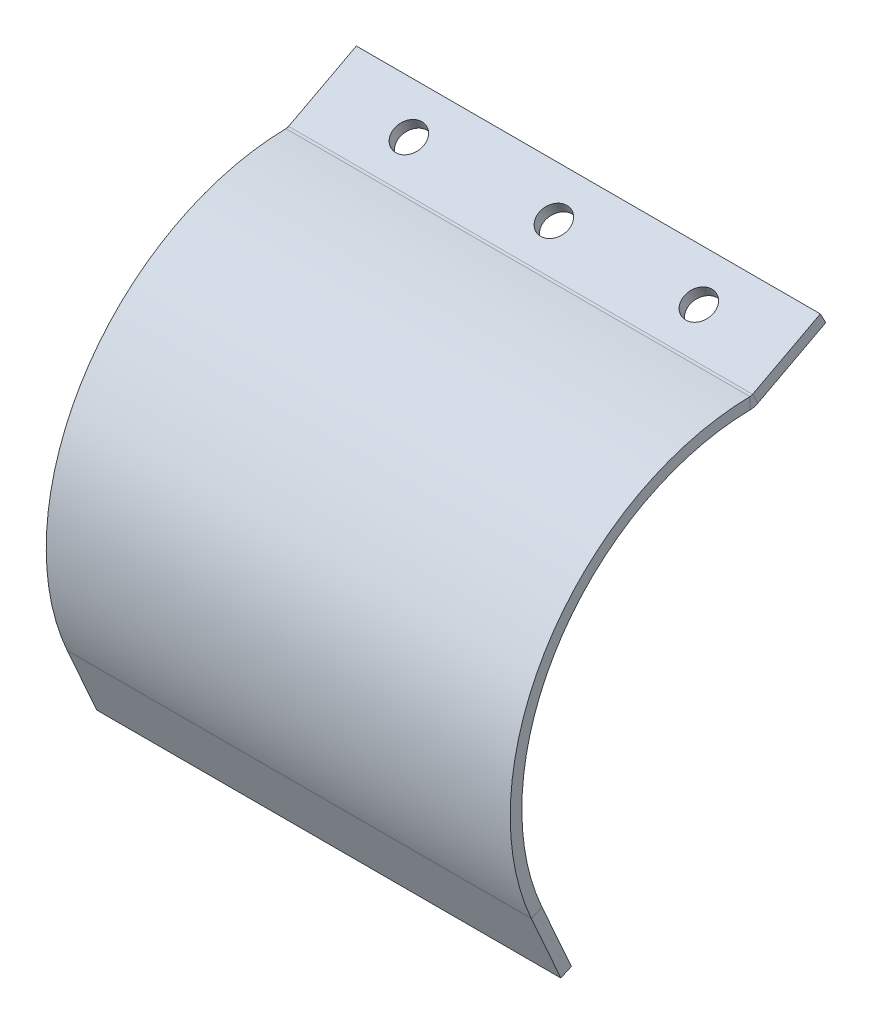
ISO-10303-21;
HEADER;
FILE_DESCRIPTION(('STEP AP214'),'2;1');
FILE_NAME('part.step','',(''),(''),'','','');
FILE_SCHEMA(('AUTOMOTIVE_DESIGN { 1 0 10303 214 1 1 1 1 }'));
ENDSEC;
DATA;
#1=APPLICATION_CONTEXT('core data for automotive mechanical design processes');
#2=APPLICATION_PROTOCOL_DEFINITION('international standard','automotive_design',2000,#1);
#3=PRODUCT_CONTEXT('',#1,'mechanical');
#4=PRODUCT('Part','Part','',(#3));
#5=PRODUCT_RELATED_PRODUCT_CATEGORY('part','',(#4));
#6=PRODUCT_DEFINITION_FORMATION('','',#4);
#7=PRODUCT_DEFINITION_CONTEXT('part definition',#1,'design');
#8=PRODUCT_DEFINITION('design','',#6,#7);
#9=PRODUCT_DEFINITION_SHAPE('','',#8);
#10=(LENGTH_UNIT() NAMED_UNIT(*) SI_UNIT(.MILLI.,.METRE.));
#11=(NAMED_UNIT(*) PLANE_ANGLE_UNIT() SI_UNIT($,.RADIAN.));
#12=(NAMED_UNIT(*) SI_UNIT($,.STERADIAN.) SOLID_ANGLE_UNIT());
#13=UNCERTAINTY_MEASURE_WITH_UNIT(LENGTH_MEASURE(1.E-05),#10,'distance_accuracy_value','');
#14=(GEOMETRIC_REPRESENTATION_CONTEXT(3) GLOBAL_UNCERTAINTY_ASSIGNED_CONTEXT((#13)) GLOBAL_UNIT_ASSIGNED_CONTEXT((#10,
#11,#12)) REPRESENTATION_CONTEXT('',''));
#15=CARTESIAN_POINT('',(0.,0.,0.));
#16=DIRECTION('',(0.,0.,1.));
#17=DIRECTION('',(1.,0.,0.));
#18=AXIS2_PLACEMENT_3D('',#15,#16,#17);
#19=CARTESIAN_POINT('',(80.,1.76916195043017,0.932773280679784));
#20=DIRECTION('',(1.,0.,0.));
#21=DIRECTION('',(0.,-0.466386640339892,0.884580975215084));
#22=AXIS2_PLACEMENT_3D('',#19,#20,#21);
#23=PLANE('',#22);
#24=DIRECTION('',(0.,0.884580975215083,0.466386640339892));
#25=VECTOR('',#24,1.);
#26=CARTESIAN_POINT('',(80.,-4.38997389138123,12.6146138785604));
#27=LINE('',#26,#25);
#28=CARTESIAN_POINT('',(80.,-6.1591358418114,11.6818405978806));
#29=VERTEX_POINT('',#28);
#30=CARTESIAN_POINT('',(80.,-4.38997389138123,12.6146138785604));
#31=VERTEX_POINT('',#30);
#32=EDGE_CURVE('E11',#29,#31,#27,.T.);
#33=ORIENTED_EDGE('',*,*,#32,.F.);
#34=DIRECTION('',(0.,0.466386640339892,-0.884580975215083));
#35=VECTOR('',#34,1.);
#36=CARTESIAN_POINT('',(80.,0.,0.));
#37=LINE('',#36,#35);
#38=CARTESIAN_POINT('',(80.,0.,0.));
#39=VERTEX_POINT('',#38);
#40=EDGE_CURVE('E97',#39,#29,#37,.F.);
#41=ORIENTED_EDGE('',*,*,#40,.F.);
#42=DIRECTION('',(0.,0.884580975215083,0.466386640339892));
#43=VECTOR('',#42,1.);
#44=CARTESIAN_POINT('',(80.,1.76916195043017,0.932773280679784));
#45=LINE('',#44,#43);
#46=CARTESIAN_POINT('',(80.,1.76916195043017,0.932773280679784));
#47=VERTEX_POINT('',#46);
#48=EDGE_CURVE('E51',#39,#47,#45,.T.);
#49=ORIENTED_EDGE('',*,*,#48,.T.);
#50=DIRECTION('',(0.,-0.466386640339892,0.884580975215084));
#51=VECTOR('',#50,1.);
#52=CARTESIAN_POINT('',(80.,1.76916195043017,0.932773280679784));
#53=LINE('',#52,#51);
#54=EDGE_CURVE('E100',#47,#31,#53,.T.);
#55=ORIENTED_EDGE('',*,*,#54,.T.);
#56=EDGE_LOOP('',(#33,#41,#49,#55));
#57=FACE_BOUND('',#56,.T.);
#58=ADVANCED_FACE('F41',(#57),#23,.T.);
#59=CARTESIAN_POINT('',(80.,1.76916195043017,0.932773280679784));
#60=DIRECTION('',(0.,-0.466386640339892,0.884580975215083));
#61=DIRECTION('',(-1.,0.,0.));
#62=AXIS2_PLACEMENT_3D('',#59,#60,#61);
#63=PLANE('',#62);
#64=ORIENTED_EDGE('',*,*,#48,.F.);
#65=DIRECTION('',(1.,0.,0.));
#66=VECTOR('',#65,1.);
#67=CARTESIAN_POINT('',(80.,0.,0.));
#68=LINE('',#67,#66);
#69=CARTESIAN_POINT('',(0.,0.,0.));
#70=VERTEX_POINT('',#69);
#71=EDGE_CURVE('E125',#39,#70,#68,.F.);
#72=ORIENTED_EDGE('',*,*,#71,.T.);
#73=DIRECTION('',(0.,0.884580975215083,0.466386640339892));
#74=VECTOR('',#73,1.);
#75=CARTESIAN_POINT('',(0.,1.76916195043017,0.932773280679784));
#76=LINE('',#75,#74);
#77=CARTESIAN_POINT('',(0.,1.76916195043017,0.932773280679784));
#78=VERTEX_POINT('',#77);
#79=EDGE_CURVE('E160',#70,#78,#76,.T.);
#80=ORIENTED_EDGE('',*,*,#79,.T.);
#81=DIRECTION('',(-1.,0.,0.));
#82=VECTOR('',#81,1.);
#83=CARTESIAN_POINT('',(80.,1.76916195043017,0.932773280679784));
#84=LINE('',#83,#82);
#85=EDGE_CURVE('E172',#47,#78,#84,.T.);
#86=ORIENTED_EDGE('',*,*,#85,.F.);
#87=EDGE_LOOP('',(#64,#72,#80,#86));
#88=FACE_BOUND('',#87,.T.);
#89=ADVANCED_FACE('F177',(#88),#63,.F.);
#90=CARTESIAN_POINT('',(0.,1.76916195043017,0.932773280679784));
#91=DIRECTION('',(1.,0.,0.));
#92=DIRECTION('',(0.,-0.466386640339892,0.884580975215084));
#93=AXIS2_PLACEMENT_3D('',#90,#91,#92);
#94=PLANE('',#93);
#95=ORIENTED_EDGE('',*,*,#79,.F.);
#96=DIRECTION('',(0.,0.466386640339892,-0.884580975215083));
#97=VECTOR('',#96,1.);
#98=CARTESIAN_POINT('',(0.,0.,0.));
#99=LINE('',#98,#97);
#100=CARTESIAN_POINT('',(0.,-6.1591358418114,11.6818405978806));
#101=VERTEX_POINT('',#100);
#102=EDGE_CURVE('E120',#70,#101,#99,.F.);
#103=ORIENTED_EDGE('',*,*,#102,.T.);
#104=DIRECTION('',(0.,0.884580975215085,0.466386640339889));
#105=VECTOR('',#104,1.);
#106=CARTESIAN_POINT('',(0.,-4.38997389138123,12.6146138785604));
#107=LINE('',#106,#105);
#108=CARTESIAN_POINT('',(0.,-4.38997389138123,12.6146138785604));
#109=VERTEX_POINT('',#108);
#110=EDGE_CURVE('E157',#101,#109,#107,.T.);
#111=ORIENTED_EDGE('',*,*,#110,.T.);
#112=DIRECTION('',(0.,-0.466386640339892,0.884580975215084));
#113=VECTOR('',#112,1.);
#114=CARTESIAN_POINT('',(0.,1.76916195043017,0.932773280679784));
#115=LINE('',#114,#113);
#116=EDGE_CURVE('E228',#78,#109,#115,.T.);
#117=ORIENTED_EDGE('',*,*,#116,.F.);
#118=EDGE_LOOP('',(#95,#103,#111,#117));
#119=FACE_BOUND('',#118,.T.);
#120=ADVANCED_FACE('F227',(#119),#94,.F.);
#121=CARTESIAN_POINT('',(0.,-3.50539291616614,13.0810005189003));
#122=DIRECTION('',(-1.,0.,0.));
#123=DIRECTION('',(0.,0.,1.));
#124=AXIS2_PLACEMENT_3D('',#121,#122,#123);
#125=PLANE('',#124);
#126=ORIENTED_EDGE('',*,*,#110,.F.);
#127=CARTESIAN_POINT('',(0.,-3.50539291616614,13.0810005189003));
#128=DIRECTION('',(-1.,0.,0.));
#129=DIRECTION('',(0.,0.,1.));
#130=AXIS2_PLACEMENT_3D('',#127,#128,#129);
#131=CIRCLE('',#130,3.);
#132=CARTESIAN_POINT('',(0.,-6.50501666620106,13.033488854791));
#133=VERTEX_POINT('',#132);
#134=EDGE_CURVE('E116',#133,#101,#131,.F.);
#135=ORIENTED_EDGE('',*,*,#134,.F.);
#136=DIRECTION('',(0.,0.999874583344974,0.0158372213697746));
#137=VECTOR('',#136,1.);
#138=CARTESIAN_POINT('',(0.,-4.50526749951112,13.0651632975305));
#139=LINE('',#138,#137);
#140=CARTESIAN_POINT('',(0.,-4.50526749951112,13.0651632975305));
#141=VERTEX_POINT('',#140);
#142=EDGE_CURVE('E154',#133,#141,#139,.T.);
#143=ORIENTED_EDGE('',*,*,#142,.T.);
#144=CARTESIAN_POINT('',(0.,-3.50539291616614,13.0810005189003));
#145=DIRECTION('',(1.,0.,0.));
#146=DIRECTION('',(0.,0.,-1.));
#147=AXIS2_PLACEMENT_3D('',#144,#145,#146);
#148=CIRCLE('',#147,1.);
#149=EDGE_CURVE('E180',#141,#109,#148,.T.);
#150=ORIENTED_EDGE('',*,*,#149,.T.);
#151=EDGE_LOOP('',(#126,#135,#143,#150));
#152=FACE_BOUND('',#151,.T.);
#153=ADVANCED_FACE('F402',(#152),#125,.T.);
#154=CARTESIAN_POINT('',(0.,-46.5,12.4));
#155=DIRECTION('',(-1.,0.,0.));
#156=DIRECTION('',(0.,0.,1.));
#157=AXIS2_PLACEMENT_3D('',#154,#155,#156);
#158=PLANE('',#157);
#159=ORIENTED_EDGE('',*,*,#142,.F.);
#160=CARTESIAN_POINT('',(0.,-46.5,12.4));
#161=DIRECTION('',(-1.,0.,0.));
#162=DIRECTION('',(0.,0.,1.));
#163=AXIS2_PLACEMENT_3D('',#160,#161,#162);
#164=CIRCLE('',#163,40.);
#165=CARTESIAN_POINT('',(0.,-62.7694657230322,48.941818305704));
#166=VERTEX_POINT('',#165);
#167=EDGE_CURVE('E216',#133,#166,#164,.F.);
#168=ORIENTED_EDGE('',*,*,#167,.T.);
#169=DIRECTION('',(0.,-0.406736643075803,0.913545457642599));
#170=VECTOR('',#169,1.);
#171=CARTESIAN_POINT('',(0.,-63.5829390091838,50.7689092209892));
#172=LINE('',#171,#170);
#173=CARTESIAN_POINT('',(0.,-63.5829390091838,50.7689092209892));
#174=VERTEX_POINT('',#173);
#175=EDGE_CURVE('E59',#166,#174,#172,.T.);
#176=ORIENTED_EDGE('',*,*,#175,.T.);
#177=CARTESIAN_POINT('',(0.,-46.5,12.4));
#178=DIRECTION('',(1.,0.,0.));
#179=DIRECTION('',(0.,0.,-1.));
#180=AXIS2_PLACEMENT_3D('',#177,#178,#179);
#181=CIRCLE('',#180,42.);
#182=EDGE_CURVE('E204',#141,#174,#181,.T.);
#183=ORIENTED_EDGE('',*,*,#182,.F.);
#184=EDGE_LOOP('',(#159,#168,#176,#183));
#185=FACE_BOUND('',#184,.T.);
#186=ADVANCED_FACE('F391',(#185),#158,.T.);
#187=CARTESIAN_POINT('',(0.,-63.5829390091838,50.7689092209891));
#188=DIRECTION('',(1.,0.,0.));
#189=DIRECTION('',(0.,-0.9135454576426,-0.406736643075803));
#190=AXIS2_PLACEMENT_3D('',#187,#188,#189);
#191=PLANE('',#190);
#192=ORIENTED_EDGE('',*,*,#175,.F.);
#193=DIRECTION('',(0.,0.9135454576426,0.406736643075803));
#194=VECTOR('',#193,1.);
#195=CARTESIAN_POINT('',(0.,-62.7694657230322,48.9418183057039));
#196=LINE('',#195,#194);
#197=CARTESIAN_POINT('',(0.,-74.2,43.8526165571953));
#198=VERTEX_POINT('',#197);
#199=EDGE_CURVE('E208',#166,#198,#196,.F.);
#200=ORIENTED_EDGE('',*,*,#199,.T.);
#201=DIRECTION('',(0.,-0.406736643075803,0.913545457642599));
#202=VECTOR('',#201,1.);
#203=CARTESIAN_POINT('',(0.,-75.0134732861516,45.6797074724806));
#204=LINE('',#203,#202);
#205=CARTESIAN_POINT('',(0.,-75.0134732861516,45.6797074724806));
#206=VERTEX_POINT('',#205);
#207=EDGE_CURVE('E150',#198,#206,#204,.T.);
#208=ORIENTED_EDGE('',*,*,#207,.T.);
#209=DIRECTION('',(0.,-0.9135454576426,-0.406736643075803));
#210=VECTOR('',#209,1.);
#211=CARTESIAN_POINT('',(0.,-63.5829390091838,50.7689092209891));
#212=LINE('',#211,#210);
#213=EDGE_CURVE('E189',#174,#206,#212,.T.);
#214=ORIENTED_EDGE('',*,*,#213,.F.);
#215=EDGE_LOOP('',(#192,#200,#208,#214));
#216=FACE_BOUND('',#215,.T.);
#217=ADVANCED_FACE('F381',(#216),#191,.F.);
#218=CARTESIAN_POINT('',(80.,-75.0134732861516,45.6797074724806));
#219=DIRECTION('',(0.,-0.9135454576426,-0.406736643075803));
#220=DIRECTION('',(-1.,0.,0.));
#221=AXIS2_PLACEMENT_3D('',#218,#219,#220);
#222=PLANE('',#221);
#223=ORIENTED_EDGE('',*,*,#207,.F.);
#224=DIRECTION('',(1.,0.,0.));
#225=VECTOR('',#224,1.);
#226=CARTESIAN_POINT('',(80.,-74.2,43.8526165571953));
#227=LINE('',#226,#225);
#228=CARTESIAN_POINT('',(80.,-74.2,43.8526165571953));
#229=VERTEX_POINT('',#228);
#230=EDGE_CURVE('E219',#229,#198,#227,.F.);
#231=ORIENTED_EDGE('',*,*,#230,.F.);
#232=DIRECTION('',(0.,-0.406736643075803,0.913545457642599));
#233=VECTOR('',#232,1.);
#234=CARTESIAN_POINT('',(80.,-75.0134732861516,45.6797074724806));
#235=LINE('',#234,#233);
#236=CARTESIAN_POINT('',(80.,-75.0134732861516,45.6797074724806));
#237=VERTEX_POINT('',#236);
#238=EDGE_CURVE('E147',#229,#237,#235,.T.);
#239=ORIENTED_EDGE('',*,*,#238,.T.);
#240=DIRECTION('',(-1.,0.,0.));
#241=VECTOR('',#240,1.);
#242=CARTESIAN_POINT('',(80.,-75.0134732861516,45.6797074724806));
#243=LINE('',#242,#241);
#244=EDGE_CURVE('E192',#237,#206,#243,.T.);
#245=ORIENTED_EDGE('',*,*,#244,.T.);
#246=EDGE_LOOP('',(#223,#231,#239,#245));
#247=FACE_BOUND('',#246,.T.);
#248=ADVANCED_FACE('F372',(#247),#222,.T.);
#249=CARTESIAN_POINT('',(80.,-63.5829390091838,50.7689092209891));
#250=DIRECTION('',(1.,0.,0.));
#251=DIRECTION('',(0.,-0.9135454576426,-0.406736643075803));
#252=AXIS2_PLACEMENT_3D('',#249,#250,#251);
#253=PLANE('',#252);
#254=ORIENTED_EDGE('',*,*,#238,.F.);
#255=DIRECTION('',(0.,0.9135454576426,0.406736643075803));
#256=VECTOR('',#255,1.);
#257=CARTESIAN_POINT('',(80.,-62.7694657230322,48.9418183057039));
#258=LINE('',#257,#256);
#259=CARTESIAN_POINT('',(80.,-62.7694657230322,48.941818305704));
#260=VERTEX_POINT('',#259);
#261=EDGE_CURVE('E212',#260,#229,#258,.F.);
#262=ORIENTED_EDGE('',*,*,#261,.F.);
#263=DIRECTION('',(0.,-0.406736643075804,0.913545457642599));
#264=VECTOR('',#263,1.);
#265=CARTESIAN_POINT('',(80.,-63.5829390091838,50.7689092209892));
#266=LINE('',#265,#264);
#267=CARTESIAN_POINT('',(80.,-63.5829390091838,50.7689092209892));
#268=VERTEX_POINT('',#267);
#269=EDGE_CURVE('E145',#260,#268,#266,.T.);
#270=ORIENTED_EDGE('',*,*,#269,.T.);
#271=DIRECTION('',(0.,-0.9135454576426,-0.406736643075803));
#272=VECTOR('',#271,1.);
#273=CARTESIAN_POINT('',(80.,-63.5829390091838,50.7689092209891));
#274=LINE('',#273,#272);
#275=EDGE_CURVE('E195',#268,#237,#274,.T.);
#276=ORIENTED_EDGE('',*,*,#275,.T.);
#277=EDGE_LOOP('',(#254,#262,#270,#276));
#278=FACE_BOUND('',#277,.T.);
#279=ADVANCED_FACE('F361',(#278),#253,.T.);
#280=CARTESIAN_POINT('',(80.,-46.5,12.4));
#281=DIRECTION('',(-1.,0.,0.));
#282=DIRECTION('',(0.,0.,1.));
#283=AXIS2_PLACEMENT_3D('',#280,#281,#282);
#284=PLANE('',#283);
#285=ORIENTED_EDGE('',*,*,#269,.F.);
#286=CARTESIAN_POINT('',(80.,-46.5,12.4));
#287=DIRECTION('',(-1.,0.,0.));
#288=DIRECTION('',(0.,0.,1.));
#289=AXIS2_PLACEMENT_3D('',#286,#287,#288);
#290=CIRCLE('',#289,40.);
#291=CARTESIAN_POINT('',(80.,-6.50501666620106,13.033488854791));
#292=VERTEX_POINT('',#291);
#293=EDGE_CURVE('E211',#292,#260,#290,.F.);
#294=ORIENTED_EDGE('',*,*,#293,.F.);
#295=DIRECTION('',(0.,0.999874583344974,0.0158372213697743));
#296=VECTOR('',#295,1.);
#297=CARTESIAN_POINT('',(80.,-4.50526749951112,13.0651632975305));
#298=LINE('',#297,#296);
#299=CARTESIAN_POINT('',(80.,-4.50526749951112,13.0651632975305));
#300=VERTEX_POINT('',#299);
#301=EDGE_CURVE('E45',#292,#300,#298,.T.);
#302=ORIENTED_EDGE('',*,*,#301,.T.);
#303=CARTESIAN_POINT('',(80.,-46.5,12.4));
#304=DIRECTION('',(1.,0.,0.));
#305=DIRECTION('',(0.,0.,-1.));
#306=AXIS2_PLACEMENT_3D('',#303,#304,#305);
#307=CIRCLE('',#306,42.);
#308=EDGE_CURVE('E201',#300,#268,#307,.T.);
#309=ORIENTED_EDGE('',*,*,#308,.T.);
#310=EDGE_LOOP('',(#285,#294,#302,#309));
#311=FACE_BOUND('',#310,.T.);
#312=ADVANCED_FACE('F283',(#311),#284,.F.);
#313=CARTESIAN_POINT('',(15.,-1.36650649129364,6.88009768540492));
#314=DIRECTION('',(0.,0.884580975215083,0.466386640339892));
#315=DIRECTION('',(0.,-0.466386640339892,0.884580975215083));
#316=AXIS2_PLACEMENT_3D('',#313,#314,#315);
#317=CYLINDRICAL_SURFACE('',#316,2.54999999999999);
#318=CARTESIAN_POINT('',(15.,-1.36650649129364,6.88009768540492));
#319=DIRECTION('',(0.,0.884580975215083,0.466386640339892));
#320=DIRECTION('',(0.,-0.466386640339892,0.884580975215083));
#321=AXIS2_PLACEMENT_3D('',#318,#319,#320);
#322=CIRCLE('',#321,2.54999999999999);
#323=CARTESIAN_POINT('',(15.,-2.55579242416036,9.13577917220337));
#324=VERTEX_POINT('',#323);
#325=EDGE_CURVE('E224',#324,#324,#322,.T.);
#326=ORIENTED_EDGE('',*,*,#325,.T.);
#327=EDGE_LOOP('',(#326));
#328=FACE_BOUND('',#327,.T.);
#329=CARTESIAN_POINT('',(15.,-3.1356684417238,5.94732440472513));
#330=DIRECTION('',(0.,0.884580975215083,0.466386640339892));
#331=DIRECTION('',(0.,-0.466386640339892,0.884580975215083));
#332=AXIS2_PLACEMENT_3D('',#329,#330,#331);
#333=CIRCLE('',#332,2.54999999999999);
#334=CARTESIAN_POINT('',(15.,-4.32495437459052,8.20300589152359));
#335=VERTEX_POINT('',#334);
#336=EDGE_CURVE('E136',#335,#335,#333,.T.);
#337=ORIENTED_EDGE('',*,*,#336,.F.);
#338=EDGE_LOOP('',(#337));
#339=FACE_BOUND('',#338,.T.);
#340=ADVANCED_FACE('F242',(#328,#339),#317,.F.);
#341=CARTESIAN_POINT('',(40.,-1.36650649129364,6.88009768540492));
#342=DIRECTION('',(0.,0.884580975215083,0.466386640339892));
#343=DIRECTION('',(0.,-0.466386640339892,0.884580975215083));
#344=AXIS2_PLACEMENT_3D('',#341,#342,#343);
#345=CYLINDRICAL_SURFACE('',#344,2.54999999999999);
#346=CARTESIAN_POINT('',(40.,-1.36650649129364,6.88009768540492));
#347=DIRECTION('',(0.,0.884580975215083,0.466386640339892));
#348=DIRECTION('',(0.,-0.466386640339892,0.884580975215083));
#349=AXIS2_PLACEMENT_3D('',#346,#347,#348);
#350=CIRCLE('',#349,2.54999999999999);
#351=CARTESIAN_POINT('',(40.,-2.55579242416036,9.13577917220337));
#352=VERTEX_POINT('',#351);
#353=EDGE_CURVE('E234',#352,#352,#350,.T.);
#354=ORIENTED_EDGE('',*,*,#353,.T.);
#355=EDGE_LOOP('',(#354));
#356=FACE_BOUND('',#355,.T.);
#357=CARTESIAN_POINT('',(40.,-3.1356684417238,5.94732440472513));
#358=DIRECTION('',(0.,0.884580975215083,0.466386640339892));
#359=DIRECTION('',(0.,-0.466386640339892,0.884580975215083));
#360=AXIS2_PLACEMENT_3D('',#357,#358,#359);
#361=CIRCLE('',#360,2.54999999999999);
#362=CARTESIAN_POINT('',(40.,-4.32495437459052,8.20300589152359));
#363=VERTEX_POINT('',#362);
#364=EDGE_CURVE('E139',#363,#363,#361,.T.);
#365=ORIENTED_EDGE('',*,*,#364,.F.);
#366=EDGE_LOOP('',(#365));
#367=FACE_BOUND('',#366,.T.);
#368=ADVANCED_FACE('F256',(#356,#367),#345,.F.);
#369=CARTESIAN_POINT('',(65.,-1.36650649129364,6.88009768540492));
#370=DIRECTION('',(0.,0.884580975215083,0.466386640339892));
#371=DIRECTION('',(0.,-0.466386640339892,0.884580975215083));
#372=AXIS2_PLACEMENT_3D('',#369,#370,#371);
#373=CYLINDRICAL_SURFACE('',#372,2.54999999999998);
#374=CARTESIAN_POINT('',(65.,-1.36650649129364,6.88009768540492));
#375=DIRECTION('',(0.,0.884580975215083,0.466386640339892));
#376=DIRECTION('',(0.,-0.466386640339892,0.884580975215083));
#377=AXIS2_PLACEMENT_3D('',#374,#375,#376);
#378=CIRCLE('',#377,2.54999999999998);
#379=CARTESIAN_POINT('',(65.,-2.55579242416035,9.13577917220337));
#380=VERTEX_POINT('',#379);
#381=EDGE_CURVE('E231',#380,#380,#378,.T.);
#382=ORIENTED_EDGE('',*,*,#381,.T.);
#383=EDGE_LOOP('',(#382));
#384=FACE_BOUND('',#383,.T.);
#385=CARTESIAN_POINT('',(65.,-3.1356684417238,5.94732440472513));
#386=DIRECTION('',(0.,0.884580975215083,0.466386640339892));
#387=DIRECTION('',(0.,-0.466386640339892,0.884580975215083));
#388=AXIS2_PLACEMENT_3D('',#385,#386,#387);
#389=CIRCLE('',#388,2.54999999999998);
#390=CARTESIAN_POINT('',(65.,-4.32495437459052,8.20300589152358));
#391=VERTEX_POINT('',#390);
#392=EDGE_CURVE('E142',#391,#391,#389,.T.);
#393=ORIENTED_EDGE('',*,*,#392,.F.);
#394=EDGE_LOOP('',(#393));
#395=FACE_BOUND('',#394,.T.);
#396=ADVANCED_FACE('F43',(#384,#395),#373,.F.);
#397=CARTESIAN_POINT('',(80.,-3.50539291616614,13.0810005189003));
#398=DIRECTION('',(-1.,0.,0.));
#399=DIRECTION('',(0.,0.,1.));
#400=AXIS2_PLACEMENT_3D('',#397,#398,#399);
#401=PLANE('',#400);
#402=CARTESIAN_POINT('',(80.,-3.50539291616614,13.0810005189003));
#403=DIRECTION('',(-1.,0.,0.));
#404=DIRECTION('',(0.,0.,1.));
#405=AXIS2_PLACEMENT_3D('',#402,#403,#404);
#406=CIRCLE('',#405,3.);
#407=EDGE_CURVE('E113',#29,#292,#406,.T.);
#408=ORIENTED_EDGE('',*,*,#407,.F.);
#409=ORIENTED_EDGE('',*,*,#32,.T.);
#410=CARTESIAN_POINT('',(80.,-3.50539291616614,13.0810005189003));
#411=DIRECTION('',(1.,0.,0.));
#412=DIRECTION('',(0.,0.,-1.));
#413=AXIS2_PLACEMENT_3D('',#410,#411,#412);
#414=CIRCLE('',#413,1.);
#415=EDGE_CURVE('E178',#31,#300,#414,.F.);
#416=ORIENTED_EDGE('',*,*,#415,.T.);
#417=ORIENTED_EDGE('',*,*,#301,.F.);
#418=EDGE_LOOP('',(#408,#409,#416,#417));
#419=FACE_BOUND('',#418,.T.);
#420=ADVANCED_FACE('F128',(#419),#401,.F.);
#421=CARTESIAN_POINT('',(80.,-46.5,12.4));
#422=DIRECTION('',(-1.,0.,0.));
#423=DIRECTION('',(0.,0.,1.));
#424=AXIS2_PLACEMENT_3D('',#421,#422,#423);
#425=CYLINDRICAL_SURFACE('',#424,42.);
#426=ORIENTED_EDGE('',*,*,#308,.F.);
#427=DIRECTION('',(-1.,0.,0.));
#428=VECTOR('',#427,1.);
#429=CARTESIAN_POINT('',(80.,-4.50526749951111,13.0651632975305));
#430=LINE('',#429,#428);
#431=EDGE_CURVE('E186',#300,#141,#430,.T.);
#432=ORIENTED_EDGE('',*,*,#431,.T.);
#433=ORIENTED_EDGE('',*,*,#182,.T.);
#434=DIRECTION('',(-1.,0.,0.));
#435=VECTOR('',#434,1.);
#436=CARTESIAN_POINT('',(80.,-63.5829390091838,50.7689092209892));
#437=LINE('',#436,#435);
#438=EDGE_CURVE('E198',#268,#174,#437,.T.);
#439=ORIENTED_EDGE('',*,*,#438,.F.);
#440=EDGE_LOOP('',(#426,#432,#433,#439));
#441=FACE_BOUND('',#440,.T.);
#442=ADVANCED_FACE('F281',(#441),#425,.T.);
#443=CARTESIAN_POINT('',(80.,-63.5829390091838,50.7689092209891));
#444=DIRECTION('',(0.,0.406736643075803,-0.913545457642599));
#445=DIRECTION('',(0.,0.9135454576426,0.406736643075803));
#446=AXIS2_PLACEMENT_3D('',#443,#444,#445);
#447=PLANE('',#446);
#448=ORIENTED_EDGE('',*,*,#213,.T.);
#449=ORIENTED_EDGE('',*,*,#244,.F.);
#450=ORIENTED_EDGE('',*,*,#275,.F.);
#451=ORIENTED_EDGE('',*,*,#438,.T.);
#452=EDGE_LOOP('',(#448,#449,#450,#451));
#453=FACE_BOUND('',#452,.T.);
#454=ADVANCED_FACE('F307',(#453),#447,.F.);
#455=CARTESIAN_POINT('',(80.,-3.50539291616614,13.0810005189003));
#456=DIRECTION('',(-1.,0.,0.));
#457=DIRECTION('',(0.,0.,1.));
#458=AXIS2_PLACEMENT_3D('',#455,#456,#457);
#459=CYLINDRICAL_SURFACE('',#458,1.);
#460=ORIENTED_EDGE('',*,*,#415,.F.);
#461=DIRECTION('',(1.,0.,0.));
#462=VECTOR('',#461,1.);
#463=CARTESIAN_POINT('',(80.,-4.38997389138123,12.6146138785604));
#464=LINE('',#463,#462);
#465=EDGE_CURVE('E175',#109,#31,#464,.T.);
#466=ORIENTED_EDGE('',*,*,#465,.F.);
#467=ORIENTED_EDGE('',*,*,#149,.F.);
#468=ORIENTED_EDGE('',*,*,#431,.F.);
#469=EDGE_LOOP('',(#460,#466,#467,#468));
#470=FACE_BOUND('',#469,.T.);
#471=ADVANCED_FACE('F248',(#470),#459,.F.);
#472=CARTESIAN_POINT('',(80.,1.76916195043017,0.932773280679784));
#473=DIRECTION('',(0.,-0.884580975215083,-0.466386640339892));
#474=DIRECTION('',(0.,0.466386640339892,-0.884580975215083));
#475=AXIS2_PLACEMENT_3D('',#472,#473,#474);
#476=PLANE('',#475);
#477=ORIENTED_EDGE('',*,*,#325,.F.);
#478=EDGE_LOOP('',(#477));
#479=FACE_BOUND('',#478,.T.);
#480=ORIENTED_EDGE('',*,*,#353,.F.);
#481=EDGE_LOOP('',(#480));
#482=FACE_BOUND('',#481,.T.);
#483=ORIENTED_EDGE('',*,*,#381,.F.);
#484=EDGE_LOOP('',(#483));
#485=FACE_BOUND('',#484,.T.);
#486=ORIENTED_EDGE('',*,*,#116,.T.);
#487=ORIENTED_EDGE('',*,*,#465,.T.);
#488=ORIENTED_EDGE('',*,*,#54,.F.);
#489=ORIENTED_EDGE('',*,*,#85,.T.);
#490=EDGE_LOOP('',(#486,#487,#488,#489));
#491=FACE_BOUND('',#490,.T.);
#492=ADVANCED_FACE('F171',(#479,#482,#485,#491),#476,.F.);
#493=CARTESIAN_POINT('',(80.,-46.5,12.4));
#494=DIRECTION('',(-1.,0.,0.));
#495=DIRECTION('',(0.,0.,1.));
#496=AXIS2_PLACEMENT_3D('',#493,#494,#495);
#497=CYLINDRICAL_SURFACE('',#496,40.);
#498=ORIENTED_EDGE('',*,*,#293,.T.);
#499=DIRECTION('',(1.,0.,0.));
#500=VECTOR('',#499,1.);
#501=CARTESIAN_POINT('',(80.,-62.7694657230322,48.941818305704));
#502=LINE('',#501,#500);
#503=EDGE_CURVE('E209',#260,#166,#502,.F.);
#504=ORIENTED_EDGE('',*,*,#503,.T.);
#505=ORIENTED_EDGE('',*,*,#167,.F.);
#506=DIRECTION('',(-1.,0.,0.));
#507=VECTOR('',#506,1.);
#508=CARTESIAN_POINT('',(80.,-6.50501666620106,13.033488854791));
#509=LINE('',#508,#507);
#510=EDGE_CURVE('E132',#292,#133,#509,.T.);
#511=ORIENTED_EDGE('',*,*,#510,.F.);
#512=EDGE_LOOP('',(#498,#504,#505,#511));
#513=FACE_BOUND('',#512,.T.);
#514=ADVANCED_FACE('F247',(#513),#497,.F.);
#515=CARTESIAN_POINT('',(80.,-62.7694657230322,48.9418183057039));
#516=DIRECTION('',(0.,0.406736643075803,-0.913545457642599));
#517=DIRECTION('',(0.,0.9135454576426,0.406736643075803));
#518=AXIS2_PLACEMENT_3D('',#515,#516,#517);
#519=PLANE('',#518);
#520=ORIENTED_EDGE('',*,*,#199,.F.);
#521=ORIENTED_EDGE('',*,*,#503,.F.);
#522=ORIENTED_EDGE('',*,*,#261,.T.);
#523=ORIENTED_EDGE('',*,*,#230,.T.);
#524=EDGE_LOOP('',(#520,#521,#522,#523));
#525=FACE_BOUND('',#524,.T.);
#526=ADVANCED_FACE('F266',(#525),#519,.T.);
#527=CARTESIAN_POINT('',(80.,-3.50539291616614,13.0810005189003));
#528=DIRECTION('',(-1.,0.,0.));
#529=DIRECTION('',(0.,0.,1.));
#530=AXIS2_PLACEMENT_3D('',#527,#528,#529);
#531=CYLINDRICAL_SURFACE('',#530,3.);
#532=ORIENTED_EDGE('',*,*,#407,.T.);
#533=ORIENTED_EDGE('',*,*,#510,.T.);
#534=ORIENTED_EDGE('',*,*,#134,.T.);
#535=DIRECTION('',(1.,0.,0.));
#536=VECTOR('',#535,1.);
#537=CARTESIAN_POINT('',(80.,-6.1591358418114,11.6818405978806));
#538=LINE('',#537,#536);
#539=EDGE_CURVE('E110',#101,#29,#538,.T.);
#540=ORIENTED_EDGE('',*,*,#539,.T.);
#541=EDGE_LOOP('',(#532,#533,#534,#540));
#542=FACE_BOUND('',#541,.T.);
#543=ADVANCED_FACE('F111',(#542),#531,.T.);
#544=CARTESIAN_POINT('',(80.,0.,0.));
#545=DIRECTION('',(0.,-0.884580975215083,-0.466386640339892));
#546=DIRECTION('',(0.,0.466386640339892,-0.884580975215083));
#547=AXIS2_PLACEMENT_3D('',#544,#545,#546);
#548=PLANE('',#547);
#549=ORIENTED_EDGE('',*,*,#336,.T.);
#550=EDGE_LOOP('',(#549));
#551=FACE_BOUND('',#550,.T.);
#552=ORIENTED_EDGE('',*,*,#364,.T.);
#553=EDGE_LOOP('',(#552));
#554=FACE_BOUND('',#553,.T.);
#555=ORIENTED_EDGE('',*,*,#392,.T.);
#556=EDGE_LOOP('',(#555));
#557=FACE_BOUND('',#556,.T.);
#558=ORIENTED_EDGE('',*,*,#102,.F.);
#559=ORIENTED_EDGE('',*,*,#71,.F.);
#560=ORIENTED_EDGE('',*,*,#40,.T.);
#561=ORIENTED_EDGE('',*,*,#539,.F.);
#562=EDGE_LOOP('',(#558,#559,#560,#561));
#563=FACE_BOUND('',#562,.T.);
#564=ADVANCED_FACE('F123',(#551,#554,#557,#563),#548,.T.);
#565=CLOSED_SHELL('',(#58,#89,#120,#153,#186,#217,#248,#279,#312,#340,#368,#396,#420,#442,#454,
#471,#492,#514,#526,#543,#564));
#566=MANIFOLD_SOLID_BREP('B2',#565);
#567=ADVANCED_BREP_SHAPE_REPRESENTATION('',(#18,#566),#14);
#568=SHAPE_DEFINITION_REPRESENTATION(#9,#567);
ENDSEC;
END-ISO-10303-21;
